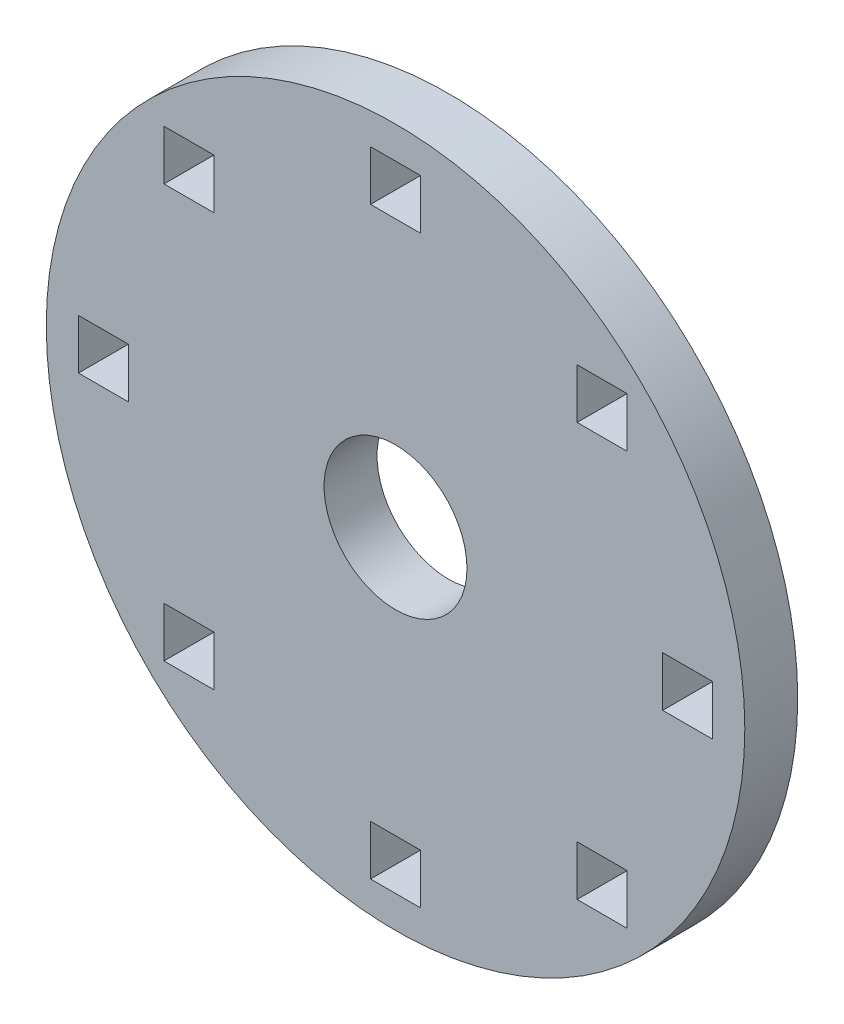
ISO-10303-21;
HEADER;
FILE_DESCRIPTION(('STEP AP214'),'2;1');
FILE_NAME('part.step','',(''),(''),'','','');
FILE_SCHEMA(('AUTOMOTIVE_DESIGN { 1 0 10303 214 1 1 1 1 }'));
ENDSEC;
DATA;
#1=APPLICATION_CONTEXT('core data for automotive mechanical design processes');
#2=APPLICATION_PROTOCOL_DEFINITION('international standard','automotive_design',2000,#1);
#3=PRODUCT_CONTEXT('',#1,'mechanical');
#4=PRODUCT('Part','Part','',(#3));
#5=PRODUCT_RELATED_PRODUCT_CATEGORY('part','',(#4));
#6=PRODUCT_DEFINITION_FORMATION('','',#4);
#7=PRODUCT_DEFINITION_CONTEXT('part definition',#1,'design');
#8=PRODUCT_DEFINITION('design','',#6,#7);
#9=PRODUCT_DEFINITION_SHAPE('','',#8);
#10=(LENGTH_UNIT() NAMED_UNIT(*) SI_UNIT(.MILLI.,.METRE.));
#11=(NAMED_UNIT(*) PLANE_ANGLE_UNIT() SI_UNIT($,.RADIAN.));
#12=(NAMED_UNIT(*) SI_UNIT($,.STERADIAN.) SOLID_ANGLE_UNIT());
#13=UNCERTAINTY_MEASURE_WITH_UNIT(LENGTH_MEASURE(1.E-05),#10,'distance_accuracy_value','');
#14=(GEOMETRIC_REPRESENTATION_CONTEXT(3) GLOBAL_UNCERTAINTY_ASSIGNED_CONTEXT((#13)) GLOBAL_UNIT_ASSIGNED_CONTEXT((#10,
#11,#12)) REPRESENTATION_CONTEXT('',''));
#15=CARTESIAN_POINT('',(0.,0.,0.));
#16=DIRECTION('',(0.,0.,1.));
#17=DIRECTION('',(1.,0.,0.));
#18=AXIS2_PLACEMENT_3D('',#15,#16,#17);
#19=CARTESIAN_POINT('',(0.,-10.8941534470754,3.175));
#20=DIRECTION('',(0.,-1.,0.));
#21=DIRECTION('',(0.,0.,-1.));
#22=AXIS2_PLACEMENT_3D('',#19,#20,#21);
#23=PLANE('',#22);
#24=DIRECTION('',(-1.,0.,0.));
#25=VECTOR('',#24,1.);
#26=CARTESIAN_POINT('',(0.,-10.8941534470754,0.));
#27=LINE('',#26,#25);
#28=CARTESIAN_POINT('',(-10.8941534470754,-10.8941534470754,0.));
#29=VERTEX_POINT('',#28);
#30=CARTESIAN_POINT('',(-13.8913534470754,-10.8941534470754,0.));
#31=VERTEX_POINT('',#30);
#32=EDGE_CURVE('E366',#29,#31,#27,.T.);
#33=ORIENTED_EDGE('',*,*,#32,.F.);
#34=DIRECTION('',(0.,0.,-1.));
#35=VECTOR('',#34,1.);
#36=CARTESIAN_POINT('',(-10.8941534470754,-10.8941534470754,3.175));
#37=LINE('',#36,#35);
#38=CARTESIAN_POINT('',(-10.8941534470754,-10.8941534470754,3.175));
#39=VERTEX_POINT('',#38);
#40=EDGE_CURVE('E11',#39,#29,#37,.T.);
#41=ORIENTED_EDGE('',*,*,#40,.F.);
#42=DIRECTION('',(-1.,0.,0.));
#43=VECTOR('',#42,1.);
#44=CARTESIAN_POINT('',(0.,-10.8941534470754,3.175));
#45=LINE('',#44,#43);
#46=CARTESIAN_POINT('',(-13.8913534470754,-10.8941534470754,3.175));
#47=VERTEX_POINT('',#46);
#48=EDGE_CURVE('E271',#39,#47,#45,.T.);
#49=ORIENTED_EDGE('',*,*,#48,.T.);
#50=DIRECTION('',(0.,0.,-1.));
#51=VECTOR('',#50,1.);
#52=CARTESIAN_POINT('',(-13.8913534470754,-10.8941534470754,3.175));
#53=LINE('',#52,#51);
#54=EDGE_CURVE('E160',#47,#31,#53,.T.);
#55=ORIENTED_EDGE('',*,*,#54,.T.);
#56=EDGE_LOOP('',(#33,#41,#49,#55));
#57=FACE_BOUND('',#56,.T.);
#58=ADVANCED_FACE('F34',(#57),#23,.T.);
#59=CARTESIAN_POINT('',(-10.8941534470754,0.,3.175));
#60=DIRECTION('',(-1.,0.,0.));
#61=DIRECTION('',(0.,0.,1.));
#62=AXIS2_PLACEMENT_3D('',#59,#60,#61);
#63=PLANE('',#62);
#64=DIRECTION('',(0.,1.,0.));
#65=VECTOR('',#64,1.);
#66=CARTESIAN_POINT('',(-10.8941534470754,0.,0.));
#67=LINE('',#66,#65);
#68=CARTESIAN_POINT('',(-10.8941534470754,-13.8913534470754,0.));
#69=VERTEX_POINT('',#68);
#70=EDGE_CURVE('E260',#69,#29,#67,.T.);
#71=ORIENTED_EDGE('',*,*,#70,.F.);
#72=DIRECTION('',(0.,0.,-1.));
#73=VECTOR('',#72,1.);
#74=CARTESIAN_POINT('',(-10.8941534470754,-13.8913534470754,3.175));
#75=LINE('',#74,#73);
#76=CARTESIAN_POINT('',(-10.8941534470754,-13.8913534470754,3.175));
#77=VERTEX_POINT('',#76);
#78=EDGE_CURVE('E44',#77,#69,#75,.T.);
#79=ORIENTED_EDGE('',*,*,#78,.F.);
#80=DIRECTION('',(0.,1.,0.));
#81=VECTOR('',#80,1.);
#82=CARTESIAN_POINT('',(-10.8941534470754,0.,3.175));
#83=LINE('',#82,#81);
#84=EDGE_CURVE('E258',#77,#39,#83,.T.);
#85=ORIENTED_EDGE('',*,*,#84,.T.);
#86=ORIENTED_EDGE('',*,*,#40,.T.);
#87=EDGE_LOOP('',(#71,#79,#85,#86));
#88=FACE_BOUND('',#87,.T.);
#89=ADVANCED_FACE('F256',(#88),#63,.T.);
#90=CARTESIAN_POINT('',(0.,-13.8913534470754,3.175));
#91=DIRECTION('',(0.,-1.,0.));
#92=DIRECTION('',(0.,0.,-1.));
#93=AXIS2_PLACEMENT_3D('',#90,#91,#92);
#94=PLANE('',#93);
#95=DIRECTION('',(-1.,0.,0.));
#96=VECTOR('',#95,1.);
#97=CARTESIAN_POINT('',(0.,-13.8913534470754,0.));
#98=LINE('',#97,#96);
#99=CARTESIAN_POINT('',(-13.8913534470754,-13.8913534470754,0.));
#100=VERTEX_POINT('',#99);
#101=EDGE_CURVE('E369',#69,#100,#98,.T.);
#102=ORIENTED_EDGE('',*,*,#101,.T.);
#103=DIRECTION('',(0.,0.,-1.));
#104=VECTOR('',#103,1.);
#105=CARTESIAN_POINT('',(-13.8913534470754,-13.8913534470754,3.175));
#106=LINE('',#105,#104);
#107=CARTESIAN_POINT('',(-13.8913534470754,-13.8913534470754,3.175));
#108=VERTEX_POINT('',#107);
#109=EDGE_CURVE('E263',#108,#100,#106,.T.);
#110=ORIENTED_EDGE('',*,*,#109,.F.);
#111=DIRECTION('',(-1.,0.,0.));
#112=VECTOR('',#111,1.);
#113=CARTESIAN_POINT('',(0.,-13.8913534470754,3.175));
#114=LINE('',#113,#112);
#115=EDGE_CURVE('E266',#77,#108,#114,.T.);
#116=ORIENTED_EDGE('',*,*,#115,.F.);
#117=ORIENTED_EDGE('',*,*,#78,.T.);
#118=EDGE_LOOP('',(#102,#110,#116,#117));
#119=FACE_BOUND('',#118,.T.);
#120=ADVANCED_FACE('F267',(#119),#94,.F.);
#121=CARTESIAN_POINT('',(0.,13.8913534470754,3.175));
#122=DIRECTION('',(0.,-1.,0.));
#123=DIRECTION('',(0.,0.,-1.));
#124=AXIS2_PLACEMENT_3D('',#121,#122,#123);
#125=PLANE('',#124);
#126=DIRECTION('',(-1.,0.,0.));
#127=VECTOR('',#126,1.);
#128=CARTESIAN_POINT('',(0.,13.8913534470754,0.));
#129=LINE('',#128,#127);
#130=CARTESIAN_POINT('',(-10.8941534470754,13.8913534470754,0.));
#131=VERTEX_POINT('',#130);
#132=CARTESIAN_POINT('',(-13.8913534470754,13.8913534470754,0.));
#133=VERTEX_POINT('',#132);
#134=EDGE_CURVE('E354',#131,#133,#129,.T.);
#135=ORIENTED_EDGE('',*,*,#134,.F.);
#136=DIRECTION('',(0.,0.,-1.));
#137=VECTOR('',#136,1.);
#138=CARTESIAN_POINT('',(-10.8941534470754,13.8913534470754,3.175));
#139=LINE('',#138,#137);
#140=CARTESIAN_POINT('',(-10.8941534470754,13.8913534470754,3.175));
#141=VERTEX_POINT('',#140);
#142=EDGE_CURVE('E377',#141,#131,#139,.T.);
#143=ORIENTED_EDGE('',*,*,#142,.F.);
#144=DIRECTION('',(-1.,0.,0.));
#145=VECTOR('',#144,1.);
#146=CARTESIAN_POINT('',(0.,13.8913534470754,3.175));
#147=LINE('',#146,#145);
#148=CARTESIAN_POINT('',(-13.8913534470754,13.8913534470754,3.175));
#149=VERTEX_POINT('',#148);
#150=EDGE_CURVE('E821',#141,#149,#147,.T.);
#151=ORIENTED_EDGE('',*,*,#150,.T.);
#152=DIRECTION('',(0.,0.,-1.));
#153=VECTOR('',#152,1.);
#154=CARTESIAN_POINT('',(-13.8913534470754,13.8913534470754,3.175));
#155=LINE('',#154,#153);
#156=EDGE_CURVE('E379',#149,#133,#155,.T.);
#157=ORIENTED_EDGE('',*,*,#156,.T.);
#158=EDGE_LOOP('',(#135,#143,#151,#157));
#159=FACE_BOUND('',#158,.T.);
#160=ADVANCED_FACE('F487',(#159),#125,.T.);
#161=CARTESIAN_POINT('',(-10.8941534470754,0.,3.175));
#162=DIRECTION('',(1.,0.,0.));
#163=DIRECTION('',(0.,0.,-1.));
#164=AXIS2_PLACEMENT_3D('',#161,#162,#163);
#165=PLANE('',#164);
#166=DIRECTION('',(0.,-1.,0.));
#167=VECTOR('',#166,1.);
#168=CARTESIAN_POINT('',(-10.8941534470754,0.,0.));
#169=LINE('',#168,#167);
#170=CARTESIAN_POINT('',(-10.8941534470754,10.8941534470754,0.));
#171=VERTEX_POINT('',#170);
#172=EDGE_CURVE('E357',#131,#171,#169,.T.);
#173=ORIENTED_EDGE('',*,*,#172,.T.);
#174=DIRECTION('',(0.,0.,-1.));
#175=VECTOR('',#174,1.);
#176=CARTESIAN_POINT('',(-10.8941534470754,10.8941534470754,3.175));
#177=LINE('',#176,#175);
#178=CARTESIAN_POINT('',(-10.8941534470754,10.8941534470754,3.175));
#179=VERTEX_POINT('',#178);
#180=EDGE_CURVE('E384',#179,#171,#177,.T.);
#181=ORIENTED_EDGE('',*,*,#180,.F.);
#182=DIRECTION('',(0.,-1.,0.));
#183=VECTOR('',#182,1.);
#184=CARTESIAN_POINT('',(-10.8941534470754,0.,3.175));
#185=LINE('',#184,#183);
#186=EDGE_CURVE('E824',#141,#179,#185,.T.);
#187=ORIENTED_EDGE('',*,*,#186,.F.);
#188=ORIENTED_EDGE('',*,*,#142,.T.);
#189=EDGE_LOOP('',(#173,#181,#187,#188));
#190=FACE_BOUND('',#189,.T.);
#191=ADVANCED_FACE('F483',(#190),#165,.F.);
#192=CARTESIAN_POINT('',(0.,10.8941534470754,3.175));
#193=DIRECTION('',(0.,-1.,0.));
#194=DIRECTION('',(0.,0.,-1.));
#195=AXIS2_PLACEMENT_3D('',#192,#193,#194);
#196=PLANE('',#195);
#197=DIRECTION('',(-1.,0.,0.));
#198=VECTOR('',#197,1.);
#199=CARTESIAN_POINT('',(0.,10.8941534470754,0.));
#200=LINE('',#199,#198);
#201=CARTESIAN_POINT('',(-13.8913534470754,10.8941534470754,0.));
#202=VERTEX_POINT('',#201);
#203=EDGE_CURVE('E360',#171,#202,#200,.T.);
#204=ORIENTED_EDGE('',*,*,#203,.T.);
#205=DIRECTION('',(0.,0.,-1.));
#206=VECTOR('',#205,1.);
#207=CARTESIAN_POINT('',(-13.8913534470754,10.8941534470754,3.175));
#208=LINE('',#207,#206);
#209=CARTESIAN_POINT('',(-13.8913534470754,10.8941534470754,3.175));
#210=VERTEX_POINT('',#209);
#211=EDGE_CURVE('E381',#210,#202,#208,.T.);
#212=ORIENTED_EDGE('',*,*,#211,.F.);
#213=DIRECTION('',(-1.,0.,0.));
#214=VECTOR('',#213,1.);
#215=CARTESIAN_POINT('',(0.,10.8941534470754,3.175));
#216=LINE('',#215,#214);
#217=EDGE_CURVE('E827',#179,#210,#216,.T.);
#218=ORIENTED_EDGE('',*,*,#217,.F.);
#219=ORIENTED_EDGE('',*,*,#180,.T.);
#220=EDGE_LOOP('',(#204,#212,#218,#219));
#221=FACE_BOUND('',#220,.T.);
#222=ADVANCED_FACE('F479',(#221),#196,.F.);
#223=CARTESIAN_POINT('',(0.,1.4986,3.175));
#224=DIRECTION('',(0.,-1.,0.));
#225=DIRECTION('',(0.,0.,-1.));
#226=AXIS2_PLACEMENT_3D('',#223,#224,#225);
#227=PLANE('',#226);
#228=DIRECTION('',(-1.,0.,0.));
#229=VECTOR('',#228,1.);
#230=CARTESIAN_POINT('',(0.,1.4986,0.));
#231=LINE('',#230,#229);
#232=CARTESIAN_POINT('',(-16.0274,1.4986,0.));
#233=VERTEX_POINT('',#232);
#234=CARTESIAN_POINT('',(-19.0246,1.4986,0.));
#235=VERTEX_POINT('',#234);
#236=EDGE_CURVE('E342',#233,#235,#231,.T.);
#237=ORIENTED_EDGE('',*,*,#236,.F.);
#238=DIRECTION('',(0.,0.,-1.));
#239=VECTOR('',#238,1.);
#240=CARTESIAN_POINT('',(-16.0274,1.4986,3.175));
#241=LINE('',#240,#239);
#242=CARTESIAN_POINT('',(-16.0274,1.4986,3.175));
#243=VERTEX_POINT('',#242);
#244=EDGE_CURVE('E382',#243,#233,#241,.T.);
#245=ORIENTED_EDGE('',*,*,#244,.F.);
#246=DIRECTION('',(-1.,0.,0.));
#247=VECTOR('',#246,1.);
#248=CARTESIAN_POINT('',(0.,1.4986,3.175));
#249=LINE('',#248,#247);
#250=CARTESIAN_POINT('',(-19.0246,1.4986,3.175));
#251=VERTEX_POINT('',#250);
#252=EDGE_CURVE('E810',#243,#251,#249,.T.);
#253=ORIENTED_EDGE('',*,*,#252,.T.);
#254=DIRECTION('',(0.,0.,-1.));
#255=VECTOR('',#254,1.);
#256=CARTESIAN_POINT('',(-19.0246,1.4986,3.175));
#257=LINE('',#256,#255);
#258=EDGE_CURVE('E388',#251,#235,#257,.T.);
#259=ORIENTED_EDGE('',*,*,#258,.T.);
#260=EDGE_LOOP('',(#237,#245,#253,#259));
#261=FACE_BOUND('',#260,.T.);
#262=ADVANCED_FACE('F482',(#261),#227,.T.);
#263=CARTESIAN_POINT('',(-16.0274,0.,3.175));
#264=DIRECTION('',(1.,0.,0.));
#265=DIRECTION('',(0.,0.,-1.));
#266=AXIS2_PLACEMENT_3D('',#263,#264,#265);
#267=PLANE('',#266);
#268=DIRECTION('',(0.,-1.,0.));
#269=VECTOR('',#268,1.);
#270=CARTESIAN_POINT('',(-16.0274,0.,0.));
#271=LINE('',#270,#269);
#272=CARTESIAN_POINT('',(-16.0274,-1.4986,0.));
#273=VERTEX_POINT('',#272);
#274=EDGE_CURVE('E345',#233,#273,#271,.T.);
#275=ORIENTED_EDGE('',*,*,#274,.T.);
#276=DIRECTION('',(0.,0.,-1.));
#277=VECTOR('',#276,1.);
#278=CARTESIAN_POINT('',(-16.0274,-1.4986,3.175));
#279=LINE('',#278,#277);
#280=CARTESIAN_POINT('',(-16.0274,-1.4986,3.175));
#281=VERTEX_POINT('',#280);
#282=EDGE_CURVE('E393',#281,#273,#279,.T.);
#283=ORIENTED_EDGE('',*,*,#282,.F.);
#284=DIRECTION('',(0.,-1.,0.));
#285=VECTOR('',#284,1.);
#286=CARTESIAN_POINT('',(-16.0274,0.,3.175));
#287=LINE('',#286,#285);
#288=EDGE_CURVE('E813',#243,#281,#287,.T.);
#289=ORIENTED_EDGE('',*,*,#288,.F.);
#290=ORIENTED_EDGE('',*,*,#244,.T.);
#291=EDGE_LOOP('',(#275,#283,#289,#290));
#292=FACE_BOUND('',#291,.T.);
#293=ADVANCED_FACE('F500',(#292),#267,.F.);
#294=CARTESIAN_POINT('',(0.,-1.4986,3.175));
#295=DIRECTION('',(0.,-1.,0.));
#296=DIRECTION('',(0.,0.,-1.));
#297=AXIS2_PLACEMENT_3D('',#294,#295,#296);
#298=PLANE('',#297);
#299=DIRECTION('',(-1.,0.,0.));
#300=VECTOR('',#299,1.);
#301=CARTESIAN_POINT('',(0.,-1.4986,0.));
#302=LINE('',#301,#300);
#303=CARTESIAN_POINT('',(-19.0246,-1.4986,0.));
#304=VERTEX_POINT('',#303);
#305=EDGE_CURVE('E348',#273,#304,#302,.T.);
#306=ORIENTED_EDGE('',*,*,#305,.T.);
#307=DIRECTION('',(0.,0.,-1.));
#308=VECTOR('',#307,1.);
#309=CARTESIAN_POINT('',(-19.0246,-1.4986,3.175));
#310=LINE('',#309,#308);
#311=CARTESIAN_POINT('',(-19.0246,-1.4986,3.175));
#312=VERTEX_POINT('',#311);
#313=EDGE_CURVE('E390',#312,#304,#310,.T.);
#314=ORIENTED_EDGE('',*,*,#313,.F.);
#315=DIRECTION('',(-1.,0.,0.));
#316=VECTOR('',#315,1.);
#317=CARTESIAN_POINT('',(0.,-1.4986,3.175));
#318=LINE('',#317,#316);
#319=EDGE_CURVE('E816',#281,#312,#318,.T.);
#320=ORIENTED_EDGE('',*,*,#319,.F.);
#321=ORIENTED_EDGE('',*,*,#282,.T.);
#322=EDGE_LOOP('',(#306,#314,#320,#321));
#323=FACE_BOUND('',#322,.T.);
#324=ADVANCED_FACE('F496',(#323),#298,.F.);
#325=CARTESIAN_POINT('',(0.,19.0246,3.175));
#326=DIRECTION('',(0.,1.,0.));
#327=DIRECTION('',(0.,0.,1.));
#328=AXIS2_PLACEMENT_3D('',#325,#326,#327);
#329=PLANE('',#328);
#330=DIRECTION('',(1.,0.,0.));
#331=VECTOR('',#330,1.);
#332=CARTESIAN_POINT('',(0.,19.0246,0.));
#333=LINE('',#332,#331);
#334=CARTESIAN_POINT('',(-1.4986,19.0246,0.));
#335=VERTEX_POINT('',#334);
#336=CARTESIAN_POINT('',(1.4986,19.0246,0.));
#337=VERTEX_POINT('',#336);
#338=EDGE_CURVE('E330',#335,#337,#333,.T.);
#339=ORIENTED_EDGE('',*,*,#338,.T.);
#340=DIRECTION('',(0.,0.,-1.));
#341=VECTOR('',#340,1.);
#342=CARTESIAN_POINT('',(1.4986,19.0246,3.175));
#343=LINE('',#342,#341);
#344=CARTESIAN_POINT('',(1.4986,19.0246,3.175));
#345=VERTEX_POINT('',#344);
#346=EDGE_CURVE('E391',#345,#337,#343,.T.);
#347=ORIENTED_EDGE('',*,*,#346,.F.);
#348=DIRECTION('',(1.,0.,0.));
#349=VECTOR('',#348,1.);
#350=CARTESIAN_POINT('',(0.,19.0246,3.175));
#351=LINE('',#350,#349);
#352=CARTESIAN_POINT('',(-1.4986,19.0246,3.175));
#353=VERTEX_POINT('',#352);
#354=EDGE_CURVE('E799',#353,#345,#351,.T.);
#355=ORIENTED_EDGE('',*,*,#354,.F.);
#356=DIRECTION('',(0.,0.,-1.));
#357=VECTOR('',#356,1.);
#358=CARTESIAN_POINT('',(-1.4986,19.0246,3.175));
#359=LINE('',#358,#357);
#360=EDGE_CURVE('E397',#353,#335,#359,.T.);
#361=ORIENTED_EDGE('',*,*,#360,.T.);
#362=EDGE_LOOP('',(#339,#347,#355,#361));
#363=FACE_BOUND('',#362,.T.);
#364=ADVANCED_FACE('F499',(#363),#329,.F.);
#365=CARTESIAN_POINT('',(1.4986,0.,3.175));
#366=DIRECTION('',(1.,0.,0.));
#367=DIRECTION('',(0.,0.,-1.));
#368=AXIS2_PLACEMENT_3D('',#365,#366,#367);
#369=PLANE('',#368);
#370=DIRECTION('',(0.,-1.,0.));
#371=VECTOR('',#370,1.);
#372=CARTESIAN_POINT('',(1.4986,0.,0.));
#373=LINE('',#372,#371);
#374=CARTESIAN_POINT('',(1.4986,16.0274,0.));
#375=VERTEX_POINT('',#374);
#376=EDGE_CURVE('E333',#337,#375,#373,.T.);
#377=ORIENTED_EDGE('',*,*,#376,.T.);
#378=DIRECTION('',(0.,0.,-1.));
#379=VECTOR('',#378,1.);
#380=CARTESIAN_POINT('',(1.4986,16.0274,3.175));
#381=LINE('',#380,#379);
#382=CARTESIAN_POINT('',(1.4986,16.0274,3.175));
#383=VERTEX_POINT('',#382);
#384=EDGE_CURVE('E402',#383,#375,#381,.T.);
#385=ORIENTED_EDGE('',*,*,#384,.F.);
#386=DIRECTION('',(0.,-1.,0.));
#387=VECTOR('',#386,1.);
#388=CARTESIAN_POINT('',(1.4986,0.,3.175));
#389=LINE('',#388,#387);
#390=EDGE_CURVE('E802',#345,#383,#389,.T.);
#391=ORIENTED_EDGE('',*,*,#390,.F.);
#392=ORIENTED_EDGE('',*,*,#346,.T.);
#393=EDGE_LOOP('',(#377,#385,#391,#392));
#394=FACE_BOUND('',#393,.T.);
#395=ADVANCED_FACE('F516',(#394),#369,.F.);
#396=CARTESIAN_POINT('',(0.,16.0274,3.175));
#397=DIRECTION('',(0.,1.,0.));
#398=DIRECTION('',(0.,0.,1.));
#399=AXIS2_PLACEMENT_3D('',#396,#397,#398);
#400=PLANE('',#399);
#401=DIRECTION('',(1.,0.,0.));
#402=VECTOR('',#401,1.);
#403=CARTESIAN_POINT('',(0.,16.0274,0.));
#404=LINE('',#403,#402);
#405=CARTESIAN_POINT('',(-1.4986,16.0274,0.));
#406=VERTEX_POINT('',#405);
#407=EDGE_CURVE('E336',#406,#375,#404,.T.);
#408=ORIENTED_EDGE('',*,*,#407,.F.);
#409=DIRECTION('',(0.,0.,-1.));
#410=VECTOR('',#409,1.);
#411=CARTESIAN_POINT('',(-1.4986,16.0274,3.175));
#412=LINE('',#411,#410);
#413=CARTESIAN_POINT('',(-1.4986,16.0274,3.175));
#414=VERTEX_POINT('',#413);
#415=EDGE_CURVE('E399',#414,#406,#412,.T.);
#416=ORIENTED_EDGE('',*,*,#415,.F.);
#417=DIRECTION('',(1.,0.,0.));
#418=VECTOR('',#417,1.);
#419=CARTESIAN_POINT('',(0.,16.0274,3.175));
#420=LINE('',#419,#418);
#421=EDGE_CURVE('E804',#414,#383,#420,.T.);
#422=ORIENTED_EDGE('',*,*,#421,.T.);
#423=ORIENTED_EDGE('',*,*,#384,.T.);
#424=EDGE_LOOP('',(#408,#416,#422,#423));
#425=FACE_BOUND('',#424,.T.);
#426=ADVANCED_FACE('F512',(#425),#400,.T.);
#427=CARTESIAN_POINT('',(0.,-16.0274,3.175));
#428=DIRECTION('',(0.,1.,0.));
#429=DIRECTION('',(0.,0.,1.));
#430=AXIS2_PLACEMENT_3D('',#427,#428,#429);
#431=PLANE('',#430);
#432=DIRECTION('',(1.,0.,0.));
#433=VECTOR('',#432,1.);
#434=CARTESIAN_POINT('',(0.,-16.0274,0.));
#435=LINE('',#434,#433);
#436=CARTESIAN_POINT('',(-1.4986,-16.0274,0.));
#437=VERTEX_POINT('',#436);
#438=CARTESIAN_POINT('',(1.4986,-16.0274,0.));
#439=VERTEX_POINT('',#438);
#440=EDGE_CURVE('E318',#437,#439,#435,.T.);
#441=ORIENTED_EDGE('',*,*,#440,.T.);
#442=DIRECTION('',(0.,0.,-1.));
#443=VECTOR('',#442,1.);
#444=CARTESIAN_POINT('',(1.4986,-16.0274,3.175));
#445=LINE('',#444,#443);
#446=CARTESIAN_POINT('',(1.4986,-16.0274,3.175));
#447=VERTEX_POINT('',#446);
#448=EDGE_CURVE('E400',#447,#439,#445,.T.);
#449=ORIENTED_EDGE('',*,*,#448,.F.);
#450=DIRECTION('',(1.,0.,0.));
#451=VECTOR('',#450,1.);
#452=CARTESIAN_POINT('',(0.,-16.0274,3.175));
#453=LINE('',#452,#451);
#454=CARTESIAN_POINT('',(-1.4986,-16.0274,3.175));
#455=VERTEX_POINT('',#454);
#456=EDGE_CURVE('E788',#455,#447,#453,.T.);
#457=ORIENTED_EDGE('',*,*,#456,.F.);
#458=DIRECTION('',(0.,0.,-1.));
#459=VECTOR('',#458,1.);
#460=CARTESIAN_POINT('',(-1.4986,-16.0274,3.175));
#461=LINE('',#460,#459);
#462=EDGE_CURVE('E406',#455,#437,#461,.T.);
#463=ORIENTED_EDGE('',*,*,#462,.T.);
#464=EDGE_LOOP('',(#441,#449,#457,#463));
#465=FACE_BOUND('',#464,.T.);
#466=ADVANCED_FACE('F515',(#465),#431,.F.);
#467=CARTESIAN_POINT('',(1.4986,0.,3.175));
#468=DIRECTION('',(1.,0.,0.));
#469=DIRECTION('',(0.,0.,-1.));
#470=AXIS2_PLACEMENT_3D('',#467,#468,#469);
#471=PLANE('',#470);
#472=DIRECTION('',(0.,-1.,0.));
#473=VECTOR('',#472,1.);
#474=CARTESIAN_POINT('',(1.4986,0.,0.));
#475=LINE('',#474,#473);
#476=CARTESIAN_POINT('',(1.4986,-19.0246,0.));
#477=VERTEX_POINT('',#476);
#478=EDGE_CURVE('E321',#439,#477,#475,.T.);
#479=ORIENTED_EDGE('',*,*,#478,.T.);
#480=DIRECTION('',(0.,0.,-1.));
#481=VECTOR('',#480,1.);
#482=CARTESIAN_POINT('',(1.4986,-19.0246,3.175));
#483=LINE('',#482,#481);
#484=CARTESIAN_POINT('',(1.4986,-19.0246,3.175));
#485=VERTEX_POINT('',#484);
#486=EDGE_CURVE('E411',#485,#477,#483,.T.);
#487=ORIENTED_EDGE('',*,*,#486,.F.);
#488=DIRECTION('',(0.,-1.,0.));
#489=VECTOR('',#488,1.);
#490=CARTESIAN_POINT('',(1.4986,0.,3.175));
#491=LINE('',#490,#489);
#492=EDGE_CURVE('E791',#447,#485,#491,.T.);
#493=ORIENTED_EDGE('',*,*,#492,.F.);
#494=ORIENTED_EDGE('',*,*,#448,.T.);
#495=EDGE_LOOP('',(#479,#487,#493,#494));
#496=FACE_BOUND('',#495,.T.);
#497=ADVANCED_FACE('F532',(#496),#471,.F.);
#498=CARTESIAN_POINT('',(0.,-19.0246,3.175));
#499=DIRECTION('',(0.,1.,0.));
#500=DIRECTION('',(0.,0.,1.));
#501=AXIS2_PLACEMENT_3D('',#498,#499,#500);
#502=PLANE('',#501);
#503=DIRECTION('',(1.,0.,0.));
#504=VECTOR('',#503,1.);
#505=CARTESIAN_POINT('',(0.,-19.0246,0.));
#506=LINE('',#505,#504);
#507=CARTESIAN_POINT('',(-1.4986,-19.0246,0.));
#508=VERTEX_POINT('',#507);
#509=EDGE_CURVE('E324',#508,#477,#506,.T.);
#510=ORIENTED_EDGE('',*,*,#509,.F.);
#511=DIRECTION('',(0.,0.,-1.));
#512=VECTOR('',#511,1.);
#513=CARTESIAN_POINT('',(-1.4986,-19.0246,3.175));
#514=LINE('',#513,#512);
#515=CARTESIAN_POINT('',(-1.4986,-19.0246,3.175));
#516=VERTEX_POINT('',#515);
#517=EDGE_CURVE('E408',#516,#508,#514,.T.);
#518=ORIENTED_EDGE('',*,*,#517,.F.);
#519=DIRECTION('',(1.,0.,0.));
#520=VECTOR('',#519,1.);
#521=CARTESIAN_POINT('',(0.,-19.0246,3.175));
#522=LINE('',#521,#520);
#523=EDGE_CURVE('E793',#516,#485,#522,.T.);
#524=ORIENTED_EDGE('',*,*,#523,.T.);
#525=ORIENTED_EDGE('',*,*,#486,.T.);
#526=EDGE_LOOP('',(#510,#518,#524,#525));
#527=FACE_BOUND('',#526,.T.);
#528=ADVANCED_FACE('F528',(#527),#502,.T.);
#529=CARTESIAN_POINT('',(0.,1.4986,3.175));
#530=DIRECTION('',(0.,1.,0.));
#531=DIRECTION('',(0.,0.,1.));
#532=AXIS2_PLACEMENT_3D('',#529,#530,#531);
#533=PLANE('',#532);
#534=DIRECTION('',(1.,0.,0.));
#535=VECTOR('',#534,1.);
#536=CARTESIAN_POINT('',(0.,1.4986,0.));
#537=LINE('',#536,#535);
#538=CARTESIAN_POINT('',(16.0274,1.4986,0.));
#539=VERTEX_POINT('',#538);
#540=CARTESIAN_POINT('',(19.0246,1.4986,0.));
#541=VERTEX_POINT('',#540);
#542=EDGE_CURVE('E306',#539,#541,#537,.T.);
#543=ORIENTED_EDGE('',*,*,#542,.T.);
#544=DIRECTION('',(0.,0.,-1.));
#545=VECTOR('',#544,1.);
#546=CARTESIAN_POINT('',(19.0246,1.4986,3.175));
#547=LINE('',#546,#545);
#548=CARTESIAN_POINT('',(19.0246,1.4986,3.175));
#549=VERTEX_POINT('',#548);
#550=EDGE_CURVE('E409',#549,#541,#547,.T.);
#551=ORIENTED_EDGE('',*,*,#550,.F.);
#552=DIRECTION('',(1.,0.,0.));
#553=VECTOR('',#552,1.);
#554=CARTESIAN_POINT('',(0.,1.4986,3.175));
#555=LINE('',#554,#553);
#556=CARTESIAN_POINT('',(16.0274,1.4986,3.175));
#557=VERTEX_POINT('',#556);
#558=EDGE_CURVE('E777',#557,#549,#555,.T.);
#559=ORIENTED_EDGE('',*,*,#558,.F.);
#560=DIRECTION('',(0.,0.,-1.));
#561=VECTOR('',#560,1.);
#562=CARTESIAN_POINT('',(16.0274,1.4986,3.175));
#563=LINE('',#562,#561);
#564=EDGE_CURVE('E415',#557,#539,#563,.T.);
#565=ORIENTED_EDGE('',*,*,#564,.T.);
#566=EDGE_LOOP('',(#543,#551,#559,#565));
#567=FACE_BOUND('',#566,.T.);
#568=ADVANCED_FACE('F531',(#567),#533,.F.);
#569=CARTESIAN_POINT('',(19.0246,0.,3.175));
#570=DIRECTION('',(1.,0.,0.));
#571=DIRECTION('',(0.,0.,-1.));
#572=AXIS2_PLACEMENT_3D('',#569,#570,#571);
#573=PLANE('',#572);
#574=DIRECTION('',(0.,-1.,0.));
#575=VECTOR('',#574,1.);
#576=CARTESIAN_POINT('',(19.0246,0.,0.));
#577=LINE('',#576,#575);
#578=CARTESIAN_POINT('',(19.0246,-1.4986,0.));
#579=VERTEX_POINT('',#578);
#580=EDGE_CURVE('E309',#541,#579,#577,.T.);
#581=ORIENTED_EDGE('',*,*,#580,.T.);
#582=DIRECTION('',(0.,0.,-1.));
#583=VECTOR('',#582,1.);
#584=CARTESIAN_POINT('',(19.0246,-1.4986,3.175));
#585=LINE('',#584,#583);
#586=CARTESIAN_POINT('',(19.0246,-1.4986,3.175));
#587=VERTEX_POINT('',#586);
#588=EDGE_CURVE('E420',#587,#579,#585,.T.);
#589=ORIENTED_EDGE('',*,*,#588,.F.);
#590=DIRECTION('',(0.,-1.,0.));
#591=VECTOR('',#590,1.);
#592=CARTESIAN_POINT('',(19.0246,0.,3.175));
#593=LINE('',#592,#591);
#594=EDGE_CURVE('E780',#549,#587,#593,.T.);
#595=ORIENTED_EDGE('',*,*,#594,.F.);
#596=ORIENTED_EDGE('',*,*,#550,.T.);
#597=EDGE_LOOP('',(#581,#589,#595,#596));
#598=FACE_BOUND('',#597,.T.);
#599=ADVANCED_FACE('F548',(#598),#573,.F.);
#600=CARTESIAN_POINT('',(0.,-1.4986,3.175));
#601=DIRECTION('',(0.,1.,0.));
#602=DIRECTION('',(0.,0.,1.));
#603=AXIS2_PLACEMENT_3D('',#600,#601,#602);
#604=PLANE('',#603);
#605=DIRECTION('',(1.,0.,0.));
#606=VECTOR('',#605,1.);
#607=CARTESIAN_POINT('',(0.,-1.4986,0.));
#608=LINE('',#607,#606);
#609=CARTESIAN_POINT('',(16.0274,-1.4986,0.));
#610=VERTEX_POINT('',#609);
#611=EDGE_CURVE('E312',#610,#579,#608,.T.);
#612=ORIENTED_EDGE('',*,*,#611,.F.);
#613=DIRECTION('',(0.,0.,-1.));
#614=VECTOR('',#613,1.);
#615=CARTESIAN_POINT('',(16.0274,-1.4986,3.175));
#616=LINE('',#615,#614);
#617=CARTESIAN_POINT('',(16.0274,-1.4986,3.175));
#618=VERTEX_POINT('',#617);
#619=EDGE_CURVE('E417',#618,#610,#616,.T.);
#620=ORIENTED_EDGE('',*,*,#619,.F.);
#621=DIRECTION('',(1.,0.,0.));
#622=VECTOR('',#621,1.);
#623=CARTESIAN_POINT('',(0.,-1.4986,3.175));
#624=LINE('',#623,#622);
#625=EDGE_CURVE('E782',#618,#587,#624,.T.);
#626=ORIENTED_EDGE('',*,*,#625,.T.);
#627=ORIENTED_EDGE('',*,*,#588,.T.);
#628=EDGE_LOOP('',(#612,#620,#626,#627));
#629=FACE_BOUND('',#628,.T.);
#630=ADVANCED_FACE('F544',(#629),#604,.T.);
#631=CARTESIAN_POINT('',(0.,13.8913534470754,3.175));
#632=DIRECTION('',(0.,1.,0.));
#633=DIRECTION('',(0.,0.,1.));
#634=AXIS2_PLACEMENT_3D('',#631,#632,#633);
#635=PLANE('',#634);
#636=DIRECTION('',(1.,0.,0.));
#637=VECTOR('',#636,1.);
#638=CARTESIAN_POINT('',(0.,13.8913534470754,0.));
#639=LINE('',#638,#637);
#640=CARTESIAN_POINT('',(10.8941534470754,13.8913534470754,0.));
#641=VERTEX_POINT('',#640);
#642=CARTESIAN_POINT('',(13.8913534470754,13.8913534470754,0.));
#643=VERTEX_POINT('',#642);
#644=EDGE_CURVE('E294',#641,#643,#639,.T.);
#645=ORIENTED_EDGE('',*,*,#644,.T.);
#646=DIRECTION('',(0.,0.,-1.));
#647=VECTOR('',#646,1.);
#648=CARTESIAN_POINT('',(13.8913534470754,13.8913534470754,3.175));
#649=LINE('',#648,#647);
#650=CARTESIAN_POINT('',(13.8913534470754,13.8913534470754,3.175));
#651=VERTEX_POINT('',#650);
#652=EDGE_CURVE('E418',#651,#643,#649,.T.);
#653=ORIENTED_EDGE('',*,*,#652,.F.);
#654=DIRECTION('',(1.,0.,0.));
#655=VECTOR('',#654,1.);
#656=CARTESIAN_POINT('',(0.,13.8913534470754,3.175));
#657=LINE('',#656,#655);
#658=CARTESIAN_POINT('',(10.8941534470754,13.8913534470754,3.175));
#659=VERTEX_POINT('',#658);
#660=EDGE_CURVE('E766',#659,#651,#657,.T.);
#661=ORIENTED_EDGE('',*,*,#660,.F.);
#662=DIRECTION('',(0.,0.,-1.));
#663=VECTOR('',#662,1.);
#664=CARTESIAN_POINT('',(10.8941534470754,13.8913534470754,3.175));
#665=LINE('',#664,#663);
#666=EDGE_CURVE('E424',#659,#641,#665,.T.);
#667=ORIENTED_EDGE('',*,*,#666,.T.);
#668=EDGE_LOOP('',(#645,#653,#661,#667));
#669=FACE_BOUND('',#668,.T.);
#670=ADVANCED_FACE('F547',(#669),#635,.F.);
#671=CARTESIAN_POINT('',(13.8913534470754,0.,3.175));
#672=DIRECTION('',(1.,0.,0.));
#673=DIRECTION('',(0.,0.,-1.));
#674=AXIS2_PLACEMENT_3D('',#671,#672,#673);
#675=PLANE('',#674);
#676=DIRECTION('',(0.,-1.,0.));
#677=VECTOR('',#676,1.);
#678=CARTESIAN_POINT('',(13.8913534470754,0.,0.));
#679=LINE('',#678,#677);
#680=CARTESIAN_POINT('',(13.8913534470754,10.8941534470754,0.));
#681=VERTEX_POINT('',#680);
#682=EDGE_CURVE('E297',#643,#681,#679,.T.);
#683=ORIENTED_EDGE('',*,*,#682,.T.);
#684=DIRECTION('',(0.,0.,-1.));
#685=VECTOR('',#684,1.);
#686=CARTESIAN_POINT('',(13.8913534470754,10.8941534470754,3.175));
#687=LINE('',#686,#685);
#688=CARTESIAN_POINT('',(13.8913534470754,10.8941534470754,3.175));
#689=VERTEX_POINT('',#688);
#690=EDGE_CURVE('E428',#689,#681,#687,.T.);
#691=ORIENTED_EDGE('',*,*,#690,.F.);
#692=DIRECTION('',(0.,-1.,0.));
#693=VECTOR('',#692,1.);
#694=CARTESIAN_POINT('',(13.8913534470754,0.,3.175));
#695=LINE('',#694,#693);
#696=EDGE_CURVE('E769',#651,#689,#695,.T.);
#697=ORIENTED_EDGE('',*,*,#696,.F.);
#698=ORIENTED_EDGE('',*,*,#652,.T.);
#699=EDGE_LOOP('',(#683,#691,#697,#698));
#700=FACE_BOUND('',#699,.T.);
#701=ADVANCED_FACE('F562',(#700),#675,.F.);
#702=CARTESIAN_POINT('',(0.,10.8941534470754,3.175));
#703=DIRECTION('',(0.,1.,0.));
#704=DIRECTION('',(0.,0.,1.));
#705=AXIS2_PLACEMENT_3D('',#702,#703,#704);
#706=PLANE('',#705);
#707=DIRECTION('',(1.,0.,0.));
#708=VECTOR('',#707,1.);
#709=CARTESIAN_POINT('',(0.,10.8941534470754,0.));
#710=LINE('',#709,#708);
#711=CARTESIAN_POINT('',(10.8941534470754,10.8941534470754,0.));
#712=VERTEX_POINT('',#711);
#713=EDGE_CURVE('E300',#712,#681,#710,.T.);
#714=ORIENTED_EDGE('',*,*,#713,.F.);
#715=DIRECTION('',(0.,0.,-1.));
#716=VECTOR('',#715,1.);
#717=CARTESIAN_POINT('',(10.8941534470754,10.8941534470754,3.175));
#718=LINE('',#717,#716);
#719=CARTESIAN_POINT('',(10.8941534470754,10.8941534470754,3.175));
#720=VERTEX_POINT('',#719);
#721=EDGE_CURVE('E426',#720,#712,#718,.T.);
#722=ORIENTED_EDGE('',*,*,#721,.F.);
#723=DIRECTION('',(1.,0.,0.));
#724=VECTOR('',#723,1.);
#725=CARTESIAN_POINT('',(0.,10.8941534470754,3.175));
#726=LINE('',#725,#724);
#727=EDGE_CURVE('E771',#720,#689,#726,.T.);
#728=ORIENTED_EDGE('',*,*,#727,.T.);
#729=ORIENTED_EDGE('',*,*,#690,.T.);
#730=EDGE_LOOP('',(#714,#722,#728,#729));
#731=FACE_BOUND('',#730,.T.);
#732=ADVANCED_FACE('F559',(#731),#706,.T.);
#733=CARTESIAN_POINT('',(0.,-13.8913534470754,3.175));
#734=DIRECTION('',(0.,1.,0.));
#735=DIRECTION('',(0.,0.,1.));
#736=AXIS2_PLACEMENT_3D('',#733,#734,#735);
#737=PLANE('',#736);
#738=DIRECTION('',(1.,0.,0.));
#739=VECTOR('',#738,1.);
#740=CARTESIAN_POINT('',(0.,-13.8913534470754,0.));
#741=LINE('',#740,#739);
#742=CARTESIAN_POINT('',(10.8941534470754,-13.8913534470754,0.));
#743=VERTEX_POINT('',#742);
#744=CARTESIAN_POINT('',(13.8913534470754,-13.8913534470754,0.));
#745=VERTEX_POINT('',#744);
#746=EDGE_CURVE('E282',#743,#745,#741,.T.);
#747=ORIENTED_EDGE('',*,*,#746,.F.);
#748=DIRECTION('',(0.,0.,-1.));
#749=VECTOR('',#748,1.);
#750=CARTESIAN_POINT('',(10.8941534470754,-13.8913534470754,3.175));
#751=LINE('',#750,#749);
#752=CARTESIAN_POINT('',(10.8941534470754,-13.8913534470754,3.175));
#753=VERTEX_POINT('',#752);
#754=EDGE_CURVE('E38',#753,#743,#751,.T.);
#755=ORIENTED_EDGE('',*,*,#754,.F.);
#756=DIRECTION('',(1.,0.,0.));
#757=VECTOR('',#756,1.);
#758=CARTESIAN_POINT('',(0.,-13.8913534470754,3.175));
#759=LINE('',#758,#757);
#760=CARTESIAN_POINT('',(13.8913534470754,-13.8913534470754,3.175));
#761=VERTEX_POINT('',#760);
#762=EDGE_CURVE('E375',#753,#761,#759,.T.);
#763=ORIENTED_EDGE('',*,*,#762,.T.);
#764=DIRECTION('',(0.,0.,-1.));
#765=VECTOR('',#764,1.);
#766=CARTESIAN_POINT('',(13.8913534470754,-13.8913534470754,3.175));
#767=LINE('',#766,#765);
#768=EDGE_CURVE('E281',#761,#745,#767,.T.);
#769=ORIENTED_EDGE('',*,*,#768,.T.);
#770=EDGE_LOOP('',(#747,#755,#763,#769));
#771=FACE_BOUND('',#770,.T.);
#772=ADVANCED_FACE('F36',(#771),#737,.T.);
#773=CARTESIAN_POINT('',(10.8941534470754,0.,3.175));
#774=DIRECTION('',(-1.,0.,0.));
#775=DIRECTION('',(0.,0.,1.));
#776=AXIS2_PLACEMENT_3D('',#773,#774,#775);
#777=PLANE('',#776);
#778=DIRECTION('',(0.,1.,0.));
#779=VECTOR('',#778,1.);
#780=CARTESIAN_POINT('',(10.8941534470754,0.,0.));
#781=LINE('',#780,#779);
#782=CARTESIAN_POINT('',(10.8941534470754,-10.8941534470754,0.));
#783=VERTEX_POINT('',#782);
#784=EDGE_CURVE('E285',#743,#783,#781,.T.);
#785=ORIENTED_EDGE('',*,*,#784,.T.);
#786=DIRECTION('',(0.,0.,-1.));
#787=VECTOR('',#786,1.);
#788=CARTESIAN_POINT('',(10.8941534470754,-10.8941534470754,3.175));
#789=LINE('',#788,#787);
#790=CARTESIAN_POINT('',(10.8941534470754,-10.8941534470754,3.175));
#791=VERTEX_POINT('',#790);
#792=EDGE_CURVE('E434',#791,#783,#789,.T.);
#793=ORIENTED_EDGE('',*,*,#792,.F.);
#794=DIRECTION('',(0.,1.,0.));
#795=VECTOR('',#794,1.);
#796=CARTESIAN_POINT('',(10.8941534470754,0.,3.175));
#797=LINE('',#796,#795);
#798=EDGE_CURVE('E443',#753,#791,#797,.T.);
#799=ORIENTED_EDGE('',*,*,#798,.F.);
#800=ORIENTED_EDGE('',*,*,#754,.T.);
#801=EDGE_LOOP('',(#785,#793,#799,#800));
#802=FACE_BOUND('',#801,.T.);
#803=ADVANCED_FACE('F442',(#802),#777,.F.);
#804=CARTESIAN_POINT('',(0.,-10.8941534470754,3.175));
#805=DIRECTION('',(0.,1.,0.));
#806=DIRECTION('',(0.,0.,1.));
#807=AXIS2_PLACEMENT_3D('',#804,#805,#806);
#808=PLANE('',#807);
#809=DIRECTION('',(1.,0.,0.));
#810=VECTOR('',#809,1.);
#811=CARTESIAN_POINT('',(0.,-10.8941534470754,0.));
#812=LINE('',#811,#810);
#813=CARTESIAN_POINT('',(13.8913534470754,-10.8941534470754,0.));
#814=VERTEX_POINT('',#813);
#815=EDGE_CURVE('E288',#783,#814,#812,.T.);
#816=ORIENTED_EDGE('',*,*,#815,.T.);
#817=DIRECTION('',(0.,0.,-1.));
#818=VECTOR('',#817,1.);
#819=CARTESIAN_POINT('',(13.8913534470754,-10.8941534470754,3.175));
#820=LINE('',#819,#818);
#821=CARTESIAN_POINT('',(13.8913534470754,-10.8941534470754,3.175));
#822=VERTEX_POINT('',#821);
#823=EDGE_CURVE('E433',#822,#814,#820,.T.);
#824=ORIENTED_EDGE('',*,*,#823,.F.);
#825=DIRECTION('',(1.,0.,0.));
#826=VECTOR('',#825,1.);
#827=CARTESIAN_POINT('',(0.,-10.8941534470754,3.175));
#828=LINE('',#827,#826);
#829=EDGE_CURVE('E763',#791,#822,#828,.T.);
#830=ORIENTED_EDGE('',*,*,#829,.F.);
#831=ORIENTED_EDGE('',*,*,#792,.T.);
#832=EDGE_LOOP('',(#816,#824,#830,#831));
#833=FACE_BOUND('',#832,.T.);
#834=ADVANCED_FACE('F455',(#833),#808,.F.);
#835=CARTESIAN_POINT('',(-13.8913534470754,0.,3.175));
#836=DIRECTION('',(-1.,0.,0.));
#837=DIRECTION('',(0.,0.,1.));
#838=AXIS2_PLACEMENT_3D('',#835,#836,#837);
#839=PLANE('',#838);
#840=DIRECTION('',(0.,1.,0.));
#841=VECTOR('',#840,1.);
#842=CARTESIAN_POINT('',(-13.8913534470754,0.,0.));
#843=LINE('',#842,#841);
#844=EDGE_CURVE('E153',#100,#31,#843,.T.);
#845=ORIENTED_EDGE('',*,*,#844,.T.);
#846=ORIENTED_EDGE('',*,*,#54,.F.);
#847=DIRECTION('',(0.,1.,0.));
#848=VECTOR('',#847,1.);
#849=CARTESIAN_POINT('',(-13.8913534470754,0.,3.175));
#850=LINE('',#849,#848);
#851=EDGE_CURVE('E53',#108,#47,#850,.T.);
#852=ORIENTED_EDGE('',*,*,#851,.F.);
#853=ORIENTED_EDGE('',*,*,#109,.T.);
#854=EDGE_LOOP('',(#845,#846,#852,#853));
#855=FACE_BOUND('',#854,.T.);
#856=ADVANCED_FACE('F457',(#855),#839,.F.);
#857=CARTESIAN_POINT('',(-13.8913534470754,0.,3.175));
#858=DIRECTION('',(1.,0.,0.));
#859=DIRECTION('',(0.,0.,-1.));
#860=AXIS2_PLACEMENT_3D('',#857,#858,#859);
#861=PLANE('',#860);
#862=DIRECTION('',(0.,-1.,0.));
#863=VECTOR('',#862,1.);
#864=CARTESIAN_POINT('',(-13.8913534470754,0.,0.));
#865=LINE('',#864,#863);
#866=EDGE_CURVE('E363',#133,#202,#865,.T.);
#867=ORIENTED_EDGE('',*,*,#866,.F.);
#868=ORIENTED_EDGE('',*,*,#156,.F.);
#869=DIRECTION('',(0.,-1.,0.));
#870=VECTOR('',#869,1.);
#871=CARTESIAN_POINT('',(-13.8913534470754,0.,3.175));
#872=LINE('',#871,#870);
#873=EDGE_CURVE('E273',#149,#210,#872,.T.);
#874=ORIENTED_EDGE('',*,*,#873,.T.);
#875=ORIENTED_EDGE('',*,*,#211,.T.);
#876=EDGE_LOOP('',(#867,#868,#874,#875));
#877=FACE_BOUND('',#876,.T.);
#878=ADVANCED_FACE('F463',(#877),#861,.T.);
#879=CARTESIAN_POINT('',(-19.0246,0.,3.175));
#880=DIRECTION('',(1.,0.,0.));
#881=DIRECTION('',(0.,0.,-1.));
#882=AXIS2_PLACEMENT_3D('',#879,#880,#881);
#883=PLANE('',#882);
#884=DIRECTION('',(0.,-1.,0.));
#885=VECTOR('',#884,1.);
#886=CARTESIAN_POINT('',(-19.0246,0.,0.));
#887=LINE('',#886,#885);
#888=EDGE_CURVE('E351',#235,#304,#887,.T.);
#889=ORIENTED_EDGE('',*,*,#888,.F.);
#890=ORIENTED_EDGE('',*,*,#258,.F.);
#891=DIRECTION('',(0.,-1.,0.));
#892=VECTOR('',#891,1.);
#893=CARTESIAN_POINT('',(-19.0246,0.,3.175));
#894=LINE('',#893,#892);
#895=EDGE_CURVE('E818',#251,#312,#894,.T.);
#896=ORIENTED_EDGE('',*,*,#895,.T.);
#897=ORIENTED_EDGE('',*,*,#313,.T.);
#898=EDGE_LOOP('',(#889,#890,#896,#897));
#899=FACE_BOUND('',#898,.T.);
#900=ADVANCED_FACE('F477',(#899),#883,.T.);
#901=CARTESIAN_POINT('',(-1.4986,0.,3.175));
#902=DIRECTION('',(1.,0.,0.));
#903=DIRECTION('',(0.,0.,-1.));
#904=AXIS2_PLACEMENT_3D('',#901,#902,#903);
#905=PLANE('',#904);
#906=DIRECTION('',(0.,-1.,0.));
#907=VECTOR('',#906,1.);
#908=CARTESIAN_POINT('',(-1.4986,0.,0.));
#909=LINE('',#908,#907);
#910=EDGE_CURVE('E339',#335,#406,#909,.T.);
#911=ORIENTED_EDGE('',*,*,#910,.F.);
#912=ORIENTED_EDGE('',*,*,#360,.F.);
#913=DIRECTION('',(0.,-1.,0.));
#914=VECTOR('',#913,1.);
#915=CARTESIAN_POINT('',(-1.4986,0.,3.175));
#916=LINE('',#915,#914);
#917=EDGE_CURVE('E807',#353,#414,#916,.T.);
#918=ORIENTED_EDGE('',*,*,#917,.T.);
#919=ORIENTED_EDGE('',*,*,#415,.T.);
#920=EDGE_LOOP('',(#911,#912,#918,#919));
#921=FACE_BOUND('',#920,.T.);
#922=ADVANCED_FACE('F494',(#921),#905,.T.);
#923=CARTESIAN_POINT('',(-1.4986,0.,3.175));
#924=DIRECTION('',(1.,0.,0.));
#925=DIRECTION('',(0.,0.,-1.));
#926=AXIS2_PLACEMENT_3D('',#923,#924,#925);
#927=PLANE('',#926);
#928=DIRECTION('',(0.,-1.,0.));
#929=VECTOR('',#928,1.);
#930=CARTESIAN_POINT('',(-1.4986,0.,0.));
#931=LINE('',#930,#929);
#932=EDGE_CURVE('E327',#437,#508,#931,.T.);
#933=ORIENTED_EDGE('',*,*,#932,.F.);
#934=ORIENTED_EDGE('',*,*,#462,.F.);
#935=DIRECTION('',(0.,-1.,0.));
#936=VECTOR('',#935,1.);
#937=CARTESIAN_POINT('',(-1.4986,0.,3.175));
#938=LINE('',#937,#936);
#939=EDGE_CURVE('E796',#455,#516,#938,.T.);
#940=ORIENTED_EDGE('',*,*,#939,.T.);
#941=ORIENTED_EDGE('',*,*,#517,.T.);
#942=EDGE_LOOP('',(#933,#934,#940,#941));
#943=FACE_BOUND('',#942,.T.);
#944=ADVANCED_FACE('F510',(#943),#927,.T.);
#945=CARTESIAN_POINT('',(16.0274,0.,3.175));
#946=DIRECTION('',(1.,0.,0.));
#947=DIRECTION('',(0.,0.,-1.));
#948=AXIS2_PLACEMENT_3D('',#945,#946,#947);
#949=PLANE('',#948);
#950=DIRECTION('',(0.,-1.,0.));
#951=VECTOR('',#950,1.);
#952=CARTESIAN_POINT('',(16.0274,0.,0.));
#953=LINE('',#952,#951);
#954=EDGE_CURVE('E315',#539,#610,#953,.T.);
#955=ORIENTED_EDGE('',*,*,#954,.F.);
#956=ORIENTED_EDGE('',*,*,#564,.F.);
#957=DIRECTION('',(0.,-1.,0.));
#958=VECTOR('',#957,1.);
#959=CARTESIAN_POINT('',(16.0274,0.,3.175));
#960=LINE('',#959,#958);
#961=EDGE_CURVE('E785',#557,#618,#960,.T.);
#962=ORIENTED_EDGE('',*,*,#961,.T.);
#963=ORIENTED_EDGE('',*,*,#619,.T.);
#964=EDGE_LOOP('',(#955,#956,#962,#963));
#965=FACE_BOUND('',#964,.T.);
#966=ADVANCED_FACE('F526',(#965),#949,.T.);
#967=CARTESIAN_POINT('',(10.8941534470754,0.,3.175));
#968=DIRECTION('',(1.,0.,0.));
#969=DIRECTION('',(0.,0.,-1.));
#970=AXIS2_PLACEMENT_3D('',#967,#968,#969);
#971=PLANE('',#970);
#972=DIRECTION('',(0.,-1.,0.));
#973=VECTOR('',#972,1.);
#974=CARTESIAN_POINT('',(10.8941534470754,0.,0.));
#975=LINE('',#974,#973);
#976=EDGE_CURVE('E303',#641,#712,#975,.T.);
#977=ORIENTED_EDGE('',*,*,#976,.F.);
#978=ORIENTED_EDGE('',*,*,#666,.F.);
#979=DIRECTION('',(0.,-1.,0.));
#980=VECTOR('',#979,1.);
#981=CARTESIAN_POINT('',(10.8941534470754,0.,3.175));
#982=LINE('',#981,#980);
#983=EDGE_CURVE('E774',#659,#720,#982,.T.);
#984=ORIENTED_EDGE('',*,*,#983,.T.);
#985=ORIENTED_EDGE('',*,*,#721,.T.);
#986=EDGE_LOOP('',(#977,#978,#984,#985));
#987=FACE_BOUND('',#986,.T.);
#988=ADVANCED_FACE('F542',(#987),#971,.T.);
#989=CARTESIAN_POINT('',(13.8913534470754,0.,3.175));
#990=DIRECTION('',(-1.,0.,0.));
#991=DIRECTION('',(0.,0.,1.));
#992=AXIS2_PLACEMENT_3D('',#989,#990,#991);
#993=PLANE('',#992);
#994=DIRECTION('',(0.,1.,0.));
#995=VECTOR('',#994,1.);
#996=CARTESIAN_POINT('',(13.8913534470754,0.,0.));
#997=LINE('',#996,#995);
#998=EDGE_CURVE('E291',#745,#814,#997,.T.);
#999=ORIENTED_EDGE('',*,*,#998,.F.);
#1000=ORIENTED_EDGE('',*,*,#768,.F.);
#1001=DIRECTION('',(0.,1.,0.));
#1002=VECTOR('',#1001,1.);
#1003=CARTESIAN_POINT('',(13.8913534470754,0.,3.175));
#1004=LINE('',#1003,#1002);
#1005=EDGE_CURVE('E453',#761,#822,#1004,.T.);
#1006=ORIENTED_EDGE('',*,*,#1005,.T.);
#1007=ORIENTED_EDGE('',*,*,#823,.T.);
#1008=EDGE_LOOP('',(#999,#1000,#1006,#1007));
#1009=FACE_BOUND('',#1008,.T.);
#1010=ADVANCED_FACE('F452',(#1009),#993,.T.);
#1011=CARTESIAN_POINT('',(0.,0.,3.175));
#1012=DIRECTION('',(0.,0.,-1.));
#1013=DIRECTION('',(-1.,0.,0.));
#1014=AXIS2_PLACEMENT_3D('',#1011,#1012,#1013);
#1015=CYLINDRICAL_SURFACE('',#1014,20.955);
#1016=CARTESIAN_POINT('',(0.,0.,3.175));
#1017=DIRECTION('',(0.,0.,1.));
#1018=DIRECTION('',(1.,0.,0.));
#1019=AXIS2_PLACEMENT_3D('',#1016,#1017,#1018);
#1020=CIRCLE('',#1019,20.955);
#1021=CARTESIAN_POINT('',(20.955,0.,3.175));
#1022=VERTEX_POINT('',#1021);
#1023=EDGE_CURVE('E278',#1022,#1022,#1020,.T.);
#1024=ORIENTED_EDGE('',*,*,#1023,.F.);
#1025=EDGE_LOOP('',(#1024));
#1026=FACE_BOUND('',#1025,.T.);
#1027=CARTESIAN_POINT('',(0.,0.,0.));
#1028=DIRECTION('',(0.,0.,1.));
#1029=DIRECTION('',(1.,0.,0.));
#1030=AXIS2_PLACEMENT_3D('',#1027,#1028,#1029);
#1031=CIRCLE('',#1030,20.955);
#1032=CARTESIAN_POINT('',(20.955,0.,0.));
#1033=VERTEX_POINT('',#1032);
#1034=EDGE_CURVE('E372',#1033,#1033,#1031,.T.);
#1035=ORIENTED_EDGE('',*,*,#1034,.T.);
#1036=EDGE_LOOP('',(#1035));
#1037=FACE_BOUND('',#1036,.T.);
#1038=ADVANCED_FACE('F570',(#1026,#1037),#1015,.T.);
#1039=CARTESIAN_POINT('',(0.,0.,3.175));
#1040=DIRECTION('',(0.,0.,1.));
#1041=DIRECTION('',(1.,0.,0.));
#1042=AXIS2_PLACEMENT_3D('',#1039,#1040,#1041);
#1043=PLANE('',#1042);
#1044=CARTESIAN_POINT('',(0.,0.,3.175));
#1045=DIRECTION('',(0.,0.,1.));
#1046=DIRECTION('',(1.,0.,0.));
#1047=AXIS2_PLACEMENT_3D('',#1044,#1045,#1046);
#1048=CIRCLE('',#1047,4.28625);
#1049=CARTESIAN_POINT('',(4.28625,0.,3.175));
#1050=VERTEX_POINT('',#1049);
#1051=EDGE_CURVE('E757',#1050,#1050,#1048,.T.);
#1052=ORIENTED_EDGE('',*,*,#1051,.F.);
#1053=EDGE_LOOP('',(#1052));
#1054=FACE_BOUND('',#1053,.T.);
#1055=ORIENTED_EDGE('',*,*,#762,.F.);
#1056=ORIENTED_EDGE('',*,*,#798,.T.);
#1057=ORIENTED_EDGE('',*,*,#829,.T.);
#1058=ORIENTED_EDGE('',*,*,#1005,.F.);
#1059=EDGE_LOOP('',(#1055,#1056,#1057,#1058));
#1060=FACE_BOUND('',#1059,.T.);
#1061=ORIENTED_EDGE('',*,*,#660,.T.);
#1062=ORIENTED_EDGE('',*,*,#696,.T.);
#1063=ORIENTED_EDGE('',*,*,#727,.F.);
#1064=ORIENTED_EDGE('',*,*,#983,.F.);
#1065=EDGE_LOOP('',(#1061,#1062,#1063,#1064));
#1066=FACE_BOUND('',#1065,.T.);
#1067=ORIENTED_EDGE('',*,*,#558,.T.);
#1068=ORIENTED_EDGE('',*,*,#594,.T.);
#1069=ORIENTED_EDGE('',*,*,#625,.F.);
#1070=ORIENTED_EDGE('',*,*,#961,.F.);
#1071=EDGE_LOOP('',(#1067,#1068,#1069,#1070));
#1072=FACE_BOUND('',#1071,.T.);
#1073=ORIENTED_EDGE('',*,*,#456,.T.);
#1074=ORIENTED_EDGE('',*,*,#492,.T.);
#1075=ORIENTED_EDGE('',*,*,#523,.F.);
#1076=ORIENTED_EDGE('',*,*,#939,.F.);
#1077=EDGE_LOOP('',(#1073,#1074,#1075,#1076));
#1078=FACE_BOUND('',#1077,.T.);
#1079=ORIENTED_EDGE('',*,*,#354,.T.);
#1080=ORIENTED_EDGE('',*,*,#390,.T.);
#1081=ORIENTED_EDGE('',*,*,#421,.F.);
#1082=ORIENTED_EDGE('',*,*,#917,.F.);
#1083=EDGE_LOOP('',(#1079,#1080,#1081,#1082));
#1084=FACE_BOUND('',#1083,.T.);
#1085=ORIENTED_EDGE('',*,*,#252,.F.);
#1086=ORIENTED_EDGE('',*,*,#288,.T.);
#1087=ORIENTED_EDGE('',*,*,#319,.T.);
#1088=ORIENTED_EDGE('',*,*,#895,.F.);
#1089=EDGE_LOOP('',(#1085,#1086,#1087,#1088));
#1090=FACE_BOUND('',#1089,.T.);
#1091=ORIENTED_EDGE('',*,*,#150,.F.);
#1092=ORIENTED_EDGE('',*,*,#186,.T.);
#1093=ORIENTED_EDGE('',*,*,#217,.T.);
#1094=ORIENTED_EDGE('',*,*,#873,.F.);
#1095=EDGE_LOOP('',(#1091,#1092,#1093,#1094));
#1096=FACE_BOUND('',#1095,.T.);
#1097=ORIENTED_EDGE('',*,*,#48,.F.);
#1098=ORIENTED_EDGE('',*,*,#84,.F.);
#1099=ORIENTED_EDGE('',*,*,#115,.T.);
#1100=ORIENTED_EDGE('',*,*,#851,.T.);
#1101=EDGE_LOOP('',(#1097,#1098,#1099,#1100));
#1102=FACE_BOUND('',#1101,.T.);
#1103=ORIENTED_EDGE('',*,*,#1023,.T.);
#1104=EDGE_LOOP('',(#1103));
#1105=FACE_BOUND('',#1104,.T.);
#1106=ADVANCED_FACE('F269',(#1054,#1060,#1066,#1072,#1078,#1084,#1090,#1096,#1102,#1105),#1043,.T.);
#1107=CARTESIAN_POINT('',(0.,0.,0.));
#1108=DIRECTION('',(0.,0.,1.));
#1109=DIRECTION('',(1.,0.,0.));
#1110=AXIS2_PLACEMENT_3D('',#1107,#1108,#1109);
#1111=PLANE('',#1110);
#1112=CARTESIAN_POINT('',(0.,0.,0.));
#1113=DIRECTION('',(0.,0.,1.));
#1114=DIRECTION('',(1.,0.,0.));
#1115=AXIS2_PLACEMENT_3D('',#1112,#1113,#1114);
#1116=CIRCLE('',#1115,4.28625);
#1117=CARTESIAN_POINT('',(4.28625,0.,0.));
#1118=VERTEX_POINT('',#1117);
#1119=EDGE_CURVE('E286',#1118,#1118,#1116,.T.);
#1120=ORIENTED_EDGE('',*,*,#1119,.T.);
#1121=EDGE_LOOP('',(#1120));
#1122=FACE_BOUND('',#1121,.T.);
#1123=ORIENTED_EDGE('',*,*,#746,.T.);
#1124=ORIENTED_EDGE('',*,*,#998,.T.);
#1125=ORIENTED_EDGE('',*,*,#815,.F.);
#1126=ORIENTED_EDGE('',*,*,#784,.F.);
#1127=EDGE_LOOP('',(#1123,#1124,#1125,#1126));
#1128=FACE_BOUND('',#1127,.T.);
#1129=ORIENTED_EDGE('',*,*,#644,.F.);
#1130=ORIENTED_EDGE('',*,*,#976,.T.);
#1131=ORIENTED_EDGE('',*,*,#713,.T.);
#1132=ORIENTED_EDGE('',*,*,#682,.F.);
#1133=EDGE_LOOP('',(#1129,#1130,#1131,#1132));
#1134=FACE_BOUND('',#1133,.T.);
#1135=ORIENTED_EDGE('',*,*,#542,.F.);
#1136=ORIENTED_EDGE('',*,*,#954,.T.);
#1137=ORIENTED_EDGE('',*,*,#611,.T.);
#1138=ORIENTED_EDGE('',*,*,#580,.F.);
#1139=EDGE_LOOP('',(#1135,#1136,#1137,#1138));
#1140=FACE_BOUND('',#1139,.T.);
#1141=ORIENTED_EDGE('',*,*,#440,.F.);
#1142=ORIENTED_EDGE('',*,*,#932,.T.);
#1143=ORIENTED_EDGE('',*,*,#509,.T.);
#1144=ORIENTED_EDGE('',*,*,#478,.F.);
#1145=EDGE_LOOP('',(#1141,#1142,#1143,#1144));
#1146=FACE_BOUND('',#1145,.T.);
#1147=ORIENTED_EDGE('',*,*,#338,.F.);
#1148=ORIENTED_EDGE('',*,*,#910,.T.);
#1149=ORIENTED_EDGE('',*,*,#407,.T.);
#1150=ORIENTED_EDGE('',*,*,#376,.F.);
#1151=EDGE_LOOP('',(#1147,#1148,#1149,#1150));
#1152=FACE_BOUND('',#1151,.T.);
#1153=ORIENTED_EDGE('',*,*,#236,.T.);
#1154=ORIENTED_EDGE('',*,*,#888,.T.);
#1155=ORIENTED_EDGE('',*,*,#305,.F.);
#1156=ORIENTED_EDGE('',*,*,#274,.F.);
#1157=EDGE_LOOP('',(#1153,#1154,#1155,#1156));
#1158=FACE_BOUND('',#1157,.T.);
#1159=ORIENTED_EDGE('',*,*,#134,.T.);
#1160=ORIENTED_EDGE('',*,*,#866,.T.);
#1161=ORIENTED_EDGE('',*,*,#203,.F.);
#1162=ORIENTED_EDGE('',*,*,#172,.F.);
#1163=EDGE_LOOP('',(#1159,#1160,#1161,#1162));
#1164=FACE_BOUND('',#1163,.T.);
#1165=ORIENTED_EDGE('',*,*,#32,.T.);
#1166=ORIENTED_EDGE('',*,*,#844,.F.);
#1167=ORIENTED_EDGE('',*,*,#101,.F.);
#1168=ORIENTED_EDGE('',*,*,#70,.T.);
#1169=EDGE_LOOP('',(#1165,#1166,#1167,#1168));
#1170=FACE_BOUND('',#1169,.T.);
#1171=ORIENTED_EDGE('',*,*,#1034,.F.);
#1172=EDGE_LOOP('',(#1171));
#1173=FACE_BOUND('',#1172,.T.);
#1174=ADVANCED_FACE('F446',(#1122,#1128,#1134,#1140,#1146,#1152,#1158,#1164,#1170,#1173),#1111,.F.);
#1175=CARTESIAN_POINT('',(0.,0.,0.));
#1176=DIRECTION('',(0.,0.,1.));
#1177=DIRECTION('',(1.,0.,0.));
#1178=AXIS2_PLACEMENT_3D('',#1175,#1176,#1177);
#1179=CYLINDRICAL_SURFACE('',#1178,4.28625);
#1180=ORIENTED_EDGE('',*,*,#1119,.F.);
#1181=EDGE_LOOP('',(#1180));
#1182=FACE_BOUND('',#1181,.T.);
#1183=ORIENTED_EDGE('',*,*,#1051,.T.);
#1184=EDGE_LOOP('',(#1183));
#1185=FACE_BOUND('',#1184,.T.);
#1186=ADVANCED_FACE('F736',(#1182,#1185),#1179,.F.);
#1187=CLOSED_SHELL('',(#58,#89,#120,#160,#191,#222,#262,#293,#324,#364,#395,#426,#466,#497,#528,
#568,#599,#630,#670,#701,#732,#772,#803,#834,#856,#878,#900,#922,#944,#966,#988,#1010,#1038,
#1106,#1174,#1186));
#1188=MANIFOLD_SOLID_BREP('B2',#1187);
#1189=ADVANCED_BREP_SHAPE_REPRESENTATION('',(#18,#1188),#14);
#1190=SHAPE_DEFINITION_REPRESENTATION(#9,#1189);
ENDSEC;
END-ISO-10303-21;
